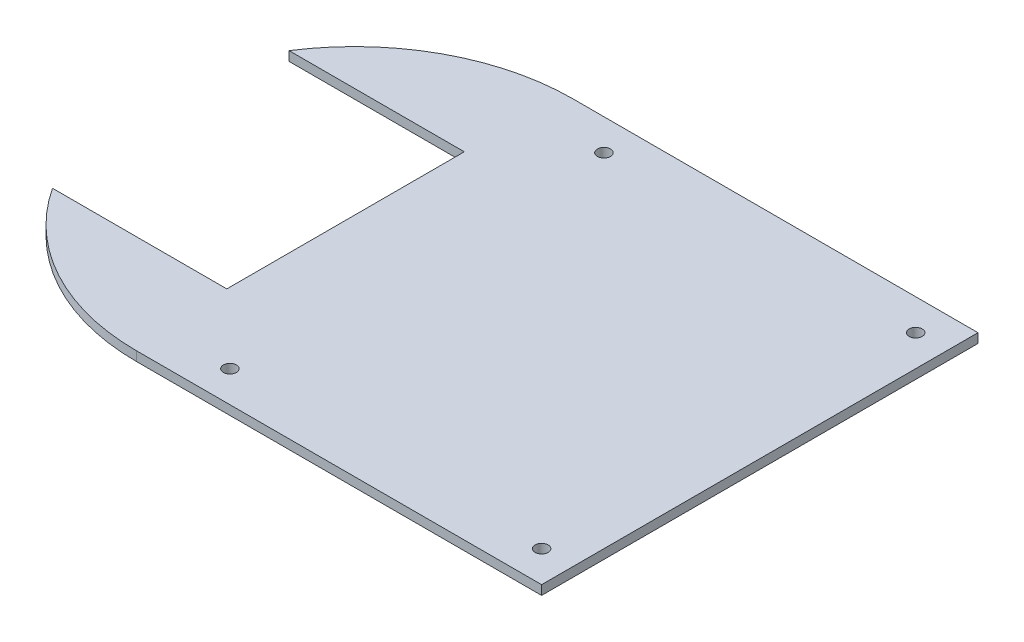
ISO-10303-21;
HEADER;
FILE_DESCRIPTION(('STEP AP214'),'2;1');
FILE_NAME('part.step','',(''),(''),'','','');
FILE_SCHEMA(('AUTOMOTIVE_DESIGN { 1 0 10303 214 1 1 1 1 }'));
ENDSEC;
DATA;
#1=APPLICATION_CONTEXT('core data for automotive mechanical design processes');
#2=APPLICATION_PROTOCOL_DEFINITION('international standard','automotive_design',2000,#1);
#3=PRODUCT_CONTEXT('',#1,'mechanical');
#4=PRODUCT('Part','Part','',(#3));
#5=PRODUCT_RELATED_PRODUCT_CATEGORY('part','',(#4));
#6=PRODUCT_DEFINITION_FORMATION('','',#4);
#7=PRODUCT_DEFINITION_CONTEXT('part definition',#1,'design');
#8=PRODUCT_DEFINITION('design','',#6,#7);
#9=PRODUCT_DEFINITION_SHAPE('','',#8);
#10=(LENGTH_UNIT() NAMED_UNIT(*) SI_UNIT(.MILLI.,.METRE.));
#11=(NAMED_UNIT(*) PLANE_ANGLE_UNIT() SI_UNIT($,.RADIAN.));
#12=(NAMED_UNIT(*) SI_UNIT($,.STERADIAN.) SOLID_ANGLE_UNIT());
#13=UNCERTAINTY_MEASURE_WITH_UNIT(LENGTH_MEASURE(1.E-05),#10,'distance_accuracy_value','');
#14=(GEOMETRIC_REPRESENTATION_CONTEXT(3) GLOBAL_UNCERTAINTY_ASSIGNED_CONTEXT((#13)) GLOBAL_UNIT_ASSIGNED_CONTEXT((#10,
#11,#12)) REPRESENTATION_CONTEXT('',''));
#15=CARTESIAN_POINT('',(0.,0.,0.));
#16=DIRECTION('',(0.,0.,1.));
#17=DIRECTION('',(1.,0.,0.));
#18=AXIS2_PLACEMENT_3D('',#15,#16,#17);
#19=CARTESIAN_POINT('',(-65.,3.,0.));
#20=DIRECTION('',(0.,-1.,0.));
#21=DIRECTION('',(0.,0.,-1.));
#22=AXIS2_PLACEMENT_3D('',#19,#20,#21);
#23=PLANE('',#22);
#24=CARTESIAN_POINT('',(-65.,3.,0.));
#25=DIRECTION('',(0.,1.,0.));
#26=DIRECTION('',(0.,0.,-1.));
#27=AXIS2_PLACEMENT_3D('',#24,#25,#26);
#28=CIRCLE('',#27,70.);
#29=CARTESIAN_POINT('',(-65.,3.,-70.));
#30=VERTEX_POINT('',#29);
#31=CARTESIAN_POINT('',(-123.87916948625,3.,-37.8582012331474));
#32=VERTEX_POINT('',#31);
#33=EDGE_CURVE('E148',#30,#32,#28,.T.);
#34=ORIENTED_EDGE('',*,*,#33,.T.);
#35=DIRECTION('',(1.,0.,0.));
#36=VECTOR('',#35,1.);
#37=CARTESIAN_POINT('',(-67.6636608634791,3.,-37.8582012331474));
#38=LINE('',#37,#36);
#39=CARTESIAN_POINT('',(-67.6636608634791,3.,-37.8582012331474));
#40=VERTEX_POINT('',#39);
#41=EDGE_CURVE('E96',#32,#40,#38,.T.);
#42=ORIENTED_EDGE('',*,*,#41,.T.);
#43=DIRECTION('',(0.,0.,1.));
#44=VECTOR('',#43,1.);
#45=CARTESIAN_POINT('',(-67.6636608634791,3.,38.3223257801271));
#46=LINE('',#45,#44);
#47=CARTESIAN_POINT('',(-67.6636608634791,3.,38.3223257801271));
#48=VERTEX_POINT('',#47);
#49=EDGE_CURVE('E163',#40,#48,#46,.T.);
#50=ORIENTED_EDGE('',*,*,#49,.T.);
#51=DIRECTION('',(-1.,0.,0.));
#52=VECTOR('',#51,1.);
#53=CARTESIAN_POINT('',(-123.578147348664,3.,38.3223257801271));
#54=LINE('',#53,#52);
#55=CARTESIAN_POINT('',(-123.578147348664,3.,38.3223257801271));
#56=VERTEX_POINT('',#55);
#57=EDGE_CURVE('E176',#48,#56,#54,.T.);
#58=ORIENTED_EDGE('',*,*,#57,.T.);
#59=CARTESIAN_POINT('',(-65.,3.,0.));
#60=DIRECTION('',(0.,1.,0.));
#61=DIRECTION('',(0.,0.,-1.));
#62=AXIS2_PLACEMENT_3D('',#59,#60,#61);
#63=CIRCLE('',#62,70.);
#64=CARTESIAN_POINT('',(-65.,3.,70.));
#65=VERTEX_POINT('',#64);
#66=EDGE_CURVE('E115',#56,#65,#63,.T.);
#67=ORIENTED_EDGE('',*,*,#66,.T.);
#68=DIRECTION('',(1.,0.,0.));
#69=VECTOR('',#68,1.);
#70=CARTESIAN_POINT('',(65.,3.,70.));
#71=LINE('',#70,#69);
#72=CARTESIAN_POINT('',(65.,3.,70.));
#73=VERTEX_POINT('',#72);
#74=EDGE_CURVE('E109',#65,#73,#71,.T.);
#75=ORIENTED_EDGE('',*,*,#74,.T.);
#76=DIRECTION('',(0.,0.,-1.));
#77=VECTOR('',#76,1.);
#78=CARTESIAN_POINT('',(65.,3.,70.));
#79=LINE('',#78,#77);
#80=CARTESIAN_POINT('',(65.,3.,-70.));
#81=VERTEX_POINT('',#80);
#82=EDGE_CURVE('E113',#73,#81,#79,.T.);
#83=ORIENTED_EDGE('',*,*,#82,.T.);
#84=DIRECTION('',(-1.,0.,0.));
#85=VECTOR('',#84,1.);
#86=CARTESIAN_POINT('',(65.,3.,-70.));
#87=LINE('',#86,#85);
#88=EDGE_CURVE('E53',#81,#30,#87,.T.);
#89=ORIENTED_EDGE('',*,*,#88,.T.);
#90=EDGE_LOOP('',(#34,#42,#50,#58,#67,#75,#83,#89));
#91=FACE_BOUND('',#90,.T.);
#92=CARTESIAN_POINT('',(-44.9997845686527,3.,-59.9998223166455));
#93=DIRECTION('',(0.,1.,0.));
#94=DIRECTION('',(0.,0.,1.));
#95=AXIS2_PLACEMENT_3D('',#92,#93,#94);
#96=CIRCLE('',#95,2.1);
#97=CARTESIAN_POINT('',(-44.9997845686527,3.,-57.8998223166455));
#98=VERTEX_POINT('',#97);
#99=EDGE_CURVE('E137',#98,#98,#96,.T.);
#100=ORIENTED_EDGE('',*,*,#99,.F.);
#101=EDGE_LOOP('',(#100));
#102=FACE_BOUND('',#101,.T.);
#103=CARTESIAN_POINT('',(-44.9997845686527,3.,60.0001776833545));
#104=DIRECTION('',(0.,1.,0.));
#105=DIRECTION('',(0.,0.,1.));
#106=AXIS2_PLACEMENT_3D('',#103,#104,#105);
#107=CIRCLE('',#106,2.1);
#108=CARTESIAN_POINT('',(-44.9997845686527,3.,62.1001776833544));
#109=VERTEX_POINT('',#108);
#110=EDGE_CURVE('E185',#109,#109,#107,.T.);
#111=ORIENTED_EDGE('',*,*,#110,.F.);
#112=EDGE_LOOP('',(#111));
#113=FACE_BOUND('',#112,.T.);
#114=CARTESIAN_POINT('',(55.0002154313473,3.,-59.9998223166455));
#115=DIRECTION('',(0.,1.,0.));
#116=DIRECTION('',(0.,0.,1.));
#117=AXIS2_PLACEMENT_3D('',#114,#115,#116);
#118=CIRCLE('',#117,2.1);
#119=CARTESIAN_POINT('',(55.0002154313473,3.,-57.8998223166455));
#120=VERTEX_POINT('',#119);
#121=EDGE_CURVE('E191',#120,#120,#118,.T.);
#122=ORIENTED_EDGE('',*,*,#121,.F.);
#123=EDGE_LOOP('',(#122));
#124=FACE_BOUND('',#123,.T.);
#125=CARTESIAN_POINT('',(55.0002154313473,3.,60.0001776833545));
#126=DIRECTION('',(0.,1.,0.));
#127=DIRECTION('',(0.,0.,1.));
#128=AXIS2_PLACEMENT_3D('',#125,#126,#127);
#129=CIRCLE('',#128,2.1);
#130=CARTESIAN_POINT('',(55.0002154313473,3.,62.1001776833545));
#131=VERTEX_POINT('',#130);
#132=EDGE_CURVE('E197',#131,#131,#129,.T.);
#133=ORIENTED_EDGE('',*,*,#132,.F.);
#134=EDGE_LOOP('',(#133));
#135=FACE_BOUND('',#134,.T.);
#136=ADVANCED_FACE('F36',(#91,#102,#113,#124,#135),#23,.F.);
#137=CARTESIAN_POINT('',(-65.,0.,0.));
#138=DIRECTION('',(0.,-1.,0.));
#139=DIRECTION('',(0.,0.,-1.));
#140=AXIS2_PLACEMENT_3D('',#137,#138,#139);
#141=PLANE('',#140);
#142=CARTESIAN_POINT('',(55.0002154313473,0.,-59.9998223166455));
#143=DIRECTION('',(0.,1.,0.));
#144=DIRECTION('',(0.,0.,1.));
#145=AXIS2_PLACEMENT_3D('',#142,#143,#144);
#146=CIRCLE('',#145,2.1);
#147=CARTESIAN_POINT('',(55.0002154313473,0.,-57.8998223166455));
#148=VERTEX_POINT('',#147);
#149=EDGE_CURVE('E194',#148,#148,#146,.T.);
#150=ORIENTED_EDGE('',*,*,#149,.T.);
#151=EDGE_LOOP('',(#150));
#152=FACE_BOUND('',#151,.T.);
#153=CARTESIAN_POINT('',(-44.9997845686527,0.,-59.9998223166455));
#154=DIRECTION('',(0.,1.,0.));
#155=DIRECTION('',(0.,0.,1.));
#156=AXIS2_PLACEMENT_3D('',#153,#154,#155);
#157=CIRCLE('',#156,2.1);
#158=CARTESIAN_POINT('',(-44.9997845686527,0.,-57.8998223166455));
#159=VERTEX_POINT('',#158);
#160=EDGE_CURVE('E182',#159,#159,#157,.T.);
#161=ORIENTED_EDGE('',*,*,#160,.T.);
#162=EDGE_LOOP('',(#161));
#163=FACE_BOUND('',#162,.T.);
#164=CARTESIAN_POINT('',(-65.,0.,0.));
#165=DIRECTION('',(0.,1.,0.));
#166=DIRECTION('',(0.,0.,-1.));
#167=AXIS2_PLACEMENT_3D('',#164,#165,#166);
#168=CIRCLE('',#167,70.);
#169=CARTESIAN_POINT('',(-65.,0.,-70.));
#170=VERTEX_POINT('',#169);
#171=CARTESIAN_POINT('',(-123.87916948625,0.,-37.8582012331474));
#172=VERTEX_POINT('',#171);
#173=EDGE_CURVE('E133',#170,#172,#168,.T.);
#174=ORIENTED_EDGE('',*,*,#173,.F.);
#175=DIRECTION('',(-1.,0.,0.));
#176=VECTOR('',#175,1.);
#177=CARTESIAN_POINT('',(65.,0.,-70.));
#178=LINE('',#177,#176);
#179=CARTESIAN_POINT('',(65.,0.,-70.));
#180=VERTEX_POINT('',#179);
#181=EDGE_CURVE('E88',#180,#170,#178,.T.);
#182=ORIENTED_EDGE('',*,*,#181,.F.);
#183=DIRECTION('',(0.,0.,-1.));
#184=VECTOR('',#183,1.);
#185=CARTESIAN_POINT('',(65.,0.,70.));
#186=LINE('',#185,#184);
#187=CARTESIAN_POINT('',(65.,0.,70.));
#188=VERTEX_POINT('',#187);
#189=EDGE_CURVE('E82',#188,#180,#186,.T.);
#190=ORIENTED_EDGE('',*,*,#189,.F.);
#191=DIRECTION('',(1.,0.,0.));
#192=VECTOR('',#191,1.);
#193=CARTESIAN_POINT('',(65.,0.,70.));
#194=LINE('',#193,#192);
#195=CARTESIAN_POINT('',(-65.,0.,70.));
#196=VERTEX_POINT('',#195);
#197=EDGE_CURVE('E123',#196,#188,#194,.T.);
#198=ORIENTED_EDGE('',*,*,#197,.F.);
#199=CARTESIAN_POINT('',(-65.,0.,0.));
#200=DIRECTION('',(0.,1.,0.));
#201=DIRECTION('',(0.,0.,-1.));
#202=AXIS2_PLACEMENT_3D('',#199,#200,#201);
#203=CIRCLE('',#202,70.);
#204=CARTESIAN_POINT('',(-123.578147348664,0.,38.3223257801271));
#205=VERTEX_POINT('',#204);
#206=EDGE_CURVE('E143',#205,#196,#203,.T.);
#207=ORIENTED_EDGE('',*,*,#206,.F.);
#208=DIRECTION('',(-1.,0.,0.));
#209=VECTOR('',#208,1.);
#210=CARTESIAN_POINT('',(-123.578147348664,0.,38.3223257801271));
#211=LINE('',#210,#209);
#212=CARTESIAN_POINT('',(-67.6636608634791,0.,38.3223257801271));
#213=VERTEX_POINT('',#212);
#214=EDGE_CURVE('E141',#213,#205,#211,.T.);
#215=ORIENTED_EDGE('',*,*,#214,.F.);
#216=DIRECTION('',(0.,0.,1.));
#217=VECTOR('',#216,1.);
#218=CARTESIAN_POINT('',(-67.6636608634791,0.,38.3223257801271));
#219=LINE('',#218,#217);
#220=CARTESIAN_POINT('',(-67.6636608634791,0.,-37.8582012331474));
#221=VERTEX_POINT('',#220);
#222=EDGE_CURVE('E139',#221,#213,#219,.T.);
#223=ORIENTED_EDGE('',*,*,#222,.F.);
#224=DIRECTION('',(1.,0.,0.));
#225=VECTOR('',#224,1.);
#226=CARTESIAN_POINT('',(-67.6636608634791,0.,-37.8582012331474));
#227=LINE('',#226,#225);
#228=EDGE_CURVE('E136',#172,#221,#227,.T.);
#229=ORIENTED_EDGE('',*,*,#228,.F.);
#230=EDGE_LOOP('',(#174,#182,#190,#198,#207,#215,#223,#229));
#231=FACE_BOUND('',#230,.T.);
#232=CARTESIAN_POINT('',(-44.9997845686527,0.,60.0001776833545));
#233=DIRECTION('',(0.,1.,0.));
#234=DIRECTION('',(0.,0.,1.));
#235=AXIS2_PLACEMENT_3D('',#232,#233,#234);
#236=CIRCLE('',#235,2.1);
#237=CARTESIAN_POINT('',(-44.9997845686527,0.,62.1001776833544));
#238=VERTEX_POINT('',#237);
#239=EDGE_CURVE('E188',#238,#238,#236,.T.);
#240=ORIENTED_EDGE('',*,*,#239,.T.);
#241=EDGE_LOOP('',(#240));
#242=FACE_BOUND('',#241,.T.);
#243=CARTESIAN_POINT('',(55.0002154313473,0.,60.0001776833545));
#244=DIRECTION('',(0.,1.,0.));
#245=DIRECTION('',(0.,0.,1.));
#246=AXIS2_PLACEMENT_3D('',#243,#244,#245);
#247=CIRCLE('',#246,2.1);
#248=CARTESIAN_POINT('',(55.0002154313473,0.,62.1001776833545));
#249=VERTEX_POINT('',#248);
#250=EDGE_CURVE('E200',#249,#249,#247,.T.);
#251=ORIENTED_EDGE('',*,*,#250,.T.);
#252=EDGE_LOOP('',(#251));
#253=FACE_BOUND('',#252,.T.);
#254=ADVANCED_FACE('F167',(#152,#163,#231,#242,#253),#141,.T.);
#255=CARTESIAN_POINT('',(-65.,3.,0.));
#256=DIRECTION('',(0.,-1.,0.));
#257=DIRECTION('',(0.,0.,-1.));
#258=AXIS2_PLACEMENT_3D('',#255,#256,#257);
#259=CYLINDRICAL_SURFACE('',#258,70.);
#260=ORIENTED_EDGE('',*,*,#173,.T.);
#261=DIRECTION('',(0.,-1.,0.));
#262=VECTOR('',#261,1.);
#263=CARTESIAN_POINT('',(-123.87916948625,3.,-37.8582012331474));
#264=LINE('',#263,#262);
#265=EDGE_CURVE('E11',#32,#172,#264,.T.);
#266=ORIENTED_EDGE('',*,*,#265,.F.);
#267=ORIENTED_EDGE('',*,*,#33,.F.);
#268=DIRECTION('',(0.,-1.,0.));
#269=VECTOR('',#268,1.);
#270=CARTESIAN_POINT('',(-65.,3.,-70.));
#271=LINE('',#270,#269);
#272=EDGE_CURVE('E129',#30,#170,#271,.T.);
#273=ORIENTED_EDGE('',*,*,#272,.T.);
#274=EDGE_LOOP('',(#260,#266,#267,#273));
#275=FACE_BOUND('',#274,.T.);
#276=ADVANCED_FACE('F38',(#275),#259,.T.);
#277=CARTESIAN_POINT('',(-67.6636608634791,3.,-37.8582012331474));
#278=DIRECTION('',(0.,0.,-1.));
#279=DIRECTION('',(-1.,0.,0.));
#280=AXIS2_PLACEMENT_3D('',#277,#278,#279);
#281=PLANE('',#280);
#282=ORIENTED_EDGE('',*,*,#228,.T.);
#283=DIRECTION('',(0.,-1.,0.));
#284=VECTOR('',#283,1.);
#285=CARTESIAN_POINT('',(-67.6636608634791,3.,-37.8582012331474));
#286=LINE('',#285,#284);
#287=EDGE_CURVE('E45',#40,#221,#286,.T.);
#288=ORIENTED_EDGE('',*,*,#287,.F.);
#289=ORIENTED_EDGE('',*,*,#41,.F.);
#290=ORIENTED_EDGE('',*,*,#265,.T.);
#291=EDGE_LOOP('',(#282,#288,#289,#290));
#292=FACE_BOUND('',#291,.T.);
#293=ADVANCED_FACE('F232',(#292),#281,.F.);
#294=CARTESIAN_POINT('',(-67.6636608634791,3.,38.3223257801271));
#295=DIRECTION('',(1.,0.,0.));
#296=DIRECTION('',(0.,0.,-1.));
#297=AXIS2_PLACEMENT_3D('',#294,#295,#296);
#298=PLANE('',#297);
#299=ORIENTED_EDGE('',*,*,#222,.T.);
#300=DIRECTION('',(0.,-1.,0.));
#301=VECTOR('',#300,1.);
#302=CARTESIAN_POINT('',(-67.6636608634791,3.,38.3223257801271));
#303=LINE('',#302,#301);
#304=EDGE_CURVE('E155',#48,#213,#303,.T.);
#305=ORIENTED_EDGE('',*,*,#304,.F.);
#306=ORIENTED_EDGE('',*,*,#49,.F.);
#307=ORIENTED_EDGE('',*,*,#287,.T.);
#308=EDGE_LOOP('',(#299,#305,#306,#307));
#309=FACE_BOUND('',#308,.T.);
#310=ADVANCED_FACE('F161',(#309),#298,.F.);
#311=CARTESIAN_POINT('',(-123.578147348664,3.,38.3223257801271));
#312=DIRECTION('',(0.,0.,1.));
#313=DIRECTION('',(1.,0.,0.));
#314=AXIS2_PLACEMENT_3D('',#311,#312,#313);
#315=PLANE('',#314);
#316=ORIENTED_EDGE('',*,*,#214,.T.);
#317=DIRECTION('',(0.,-1.,0.));
#318=VECTOR('',#317,1.);
#319=CARTESIAN_POINT('',(-123.578147348664,3.,38.3223257801271));
#320=LINE('',#319,#318);
#321=EDGE_CURVE('E152',#56,#205,#320,.T.);
#322=ORIENTED_EDGE('',*,*,#321,.F.);
#323=ORIENTED_EDGE('',*,*,#57,.F.);
#324=ORIENTED_EDGE('',*,*,#304,.T.);
#325=EDGE_LOOP('',(#316,#322,#323,#324));
#326=FACE_BOUND('',#325,.T.);
#327=ADVANCED_FACE('F172',(#326),#315,.F.);
#328=CARTESIAN_POINT('',(-65.,3.,0.));
#329=DIRECTION('',(0.,-1.,0.));
#330=DIRECTION('',(0.,0.,-1.));
#331=AXIS2_PLACEMENT_3D('',#328,#329,#330);
#332=CYLINDRICAL_SURFACE('',#331,70.);
#333=ORIENTED_EDGE('',*,*,#206,.T.);
#334=DIRECTION('',(0.,-1.,0.));
#335=VECTOR('',#334,1.);
#336=CARTESIAN_POINT('',(-65.,3.,70.));
#337=LINE('',#336,#335);
#338=EDGE_CURVE('E124',#65,#196,#337,.T.);
#339=ORIENTED_EDGE('',*,*,#338,.F.);
#340=ORIENTED_EDGE('',*,*,#66,.F.);
#341=ORIENTED_EDGE('',*,*,#321,.T.);
#342=EDGE_LOOP('',(#333,#339,#340,#341));
#343=FACE_BOUND('',#342,.T.);
#344=ADVANCED_FACE('F175',(#343),#332,.T.);
#345=CARTESIAN_POINT('',(65.,3.,70.));
#346=DIRECTION('',(0.,0.,-1.));
#347=DIRECTION('',(-1.,0.,0.));
#348=AXIS2_PLACEMENT_3D('',#345,#346,#347);
#349=PLANE('',#348);
#350=ORIENTED_EDGE('',*,*,#197,.T.);
#351=DIRECTION('',(0.,-1.,0.));
#352=VECTOR('',#351,1.);
#353=CARTESIAN_POINT('',(65.,3.,70.));
#354=LINE('',#353,#352);
#355=EDGE_CURVE('E120',#73,#188,#354,.T.);
#356=ORIENTED_EDGE('',*,*,#355,.F.);
#357=ORIENTED_EDGE('',*,*,#74,.F.);
#358=ORIENTED_EDGE('',*,*,#338,.T.);
#359=EDGE_LOOP('',(#350,#356,#357,#358));
#360=FACE_BOUND('',#359,.T.);
#361=ADVANCED_FACE('F121',(#360),#349,.F.);
#362=CARTESIAN_POINT('',(65.,3.,70.));
#363=DIRECTION('',(-1.,0.,0.));
#364=DIRECTION('',(0.,0.,1.));
#365=AXIS2_PLACEMENT_3D('',#362,#363,#364);
#366=PLANE('',#365);
#367=ORIENTED_EDGE('',*,*,#189,.T.);
#368=DIRECTION('',(0.,-1.,0.));
#369=VECTOR('',#368,1.);
#370=CARTESIAN_POINT('',(65.,3.,-70.));
#371=LINE('',#370,#369);
#372=EDGE_CURVE('E125',#81,#180,#371,.T.);
#373=ORIENTED_EDGE('',*,*,#372,.F.);
#374=ORIENTED_EDGE('',*,*,#82,.F.);
#375=ORIENTED_EDGE('',*,*,#355,.T.);
#376=EDGE_LOOP('',(#367,#373,#374,#375));
#377=FACE_BOUND('',#376,.T.);
#378=ADVANCED_FACE('F127',(#377),#366,.F.);
#379=CARTESIAN_POINT('',(65.,3.,-70.));
#380=DIRECTION('',(0.,0.,1.));
#381=DIRECTION('',(1.,0.,0.));
#382=AXIS2_PLACEMENT_3D('',#379,#380,#381);
#383=PLANE('',#382);
#384=ORIENTED_EDGE('',*,*,#181,.T.);
#385=ORIENTED_EDGE('',*,*,#272,.F.);
#386=ORIENTED_EDGE('',*,*,#88,.F.);
#387=ORIENTED_EDGE('',*,*,#372,.T.);
#388=EDGE_LOOP('',(#384,#385,#386,#387));
#389=FACE_BOUND('',#388,.T.);
#390=ADVANCED_FACE('F220',(#389),#383,.F.);
#391=CARTESIAN_POINT('',(-44.9997845686527,3.,-59.9998223166455));
#392=DIRECTION('',(0.,-1.,0.));
#393=DIRECTION('',(0.,0.,-1.));
#394=AXIS2_PLACEMENT_3D('',#391,#392,#393);
#395=CYLINDRICAL_SURFACE('',#394,2.1);
#396=ORIENTED_EDGE('',*,*,#99,.T.);
#397=EDGE_LOOP('',(#396));
#398=FACE_BOUND('',#397,.T.);
#399=ORIENTED_EDGE('',*,*,#160,.F.);
#400=EDGE_LOOP('',(#399));
#401=FACE_BOUND('',#400,.T.);
#402=ADVANCED_FACE('F217',(#398,#401),#395,.F.);
#403=CARTESIAN_POINT('',(-44.9997845686527,3.,60.0001776833545));
#404=DIRECTION('',(0.,-1.,0.));
#405=DIRECTION('',(0.,0.,-1.));
#406=AXIS2_PLACEMENT_3D('',#403,#404,#405);
#407=CYLINDRICAL_SURFACE('',#406,2.1);
#408=ORIENTED_EDGE('',*,*,#110,.T.);
#409=EDGE_LOOP('',(#408));
#410=FACE_BOUND('',#409,.T.);
#411=ORIENTED_EDGE('',*,*,#239,.F.);
#412=EDGE_LOOP('',(#411));
#413=FACE_BOUND('',#412,.T.);
#414=ADVANCED_FACE('F308',(#410,#413),#407,.F.);
#415=CARTESIAN_POINT('',(55.0002154313473,3.,-59.9998223166455));
#416=DIRECTION('',(0.,-1.,0.));
#417=DIRECTION('',(0.,0.,-1.));
#418=AXIS2_PLACEMENT_3D('',#415,#416,#417);
#419=CYLINDRICAL_SURFACE('',#418,2.1);
#420=ORIENTED_EDGE('',*,*,#121,.T.);
#421=EDGE_LOOP('',(#420));
#422=FACE_BOUND('',#421,.T.);
#423=ORIENTED_EDGE('',*,*,#149,.F.);
#424=EDGE_LOOP('',(#423));
#425=FACE_BOUND('',#424,.T.);
#426=ADVANCED_FACE('F317',(#422,#425),#419,.F.);
#427=CARTESIAN_POINT('',(55.0002154313473,3.,60.0001776833545));
#428=DIRECTION('',(0.,-1.,0.));
#429=DIRECTION('',(0.,0.,-1.));
#430=AXIS2_PLACEMENT_3D('',#427,#428,#429);
#431=CYLINDRICAL_SURFACE('',#430,2.1);
#432=ORIENTED_EDGE('',*,*,#132,.T.);
#433=EDGE_LOOP('',(#432));
#434=FACE_BOUND('',#433,.T.);
#435=ORIENTED_EDGE('',*,*,#250,.F.);
#436=EDGE_LOOP('',(#435));
#437=FACE_BOUND('',#436,.T.);
#438=ADVANCED_FACE('F206',(#434,#437),#431,.F.);
#439=CLOSED_SHELL('',(#136,#254,#276,#293,#310,#327,#344,#361,#378,#390,#402,#414,#426,#438));
#440=MANIFOLD_SOLID_BREP('B2',#439);
#441=ADVANCED_BREP_SHAPE_REPRESENTATION('',(#18,#440),#14);
#442=SHAPE_DEFINITION_REPRESENTATION(#9,#441);
ENDSEC;
END-ISO-10303-21;
